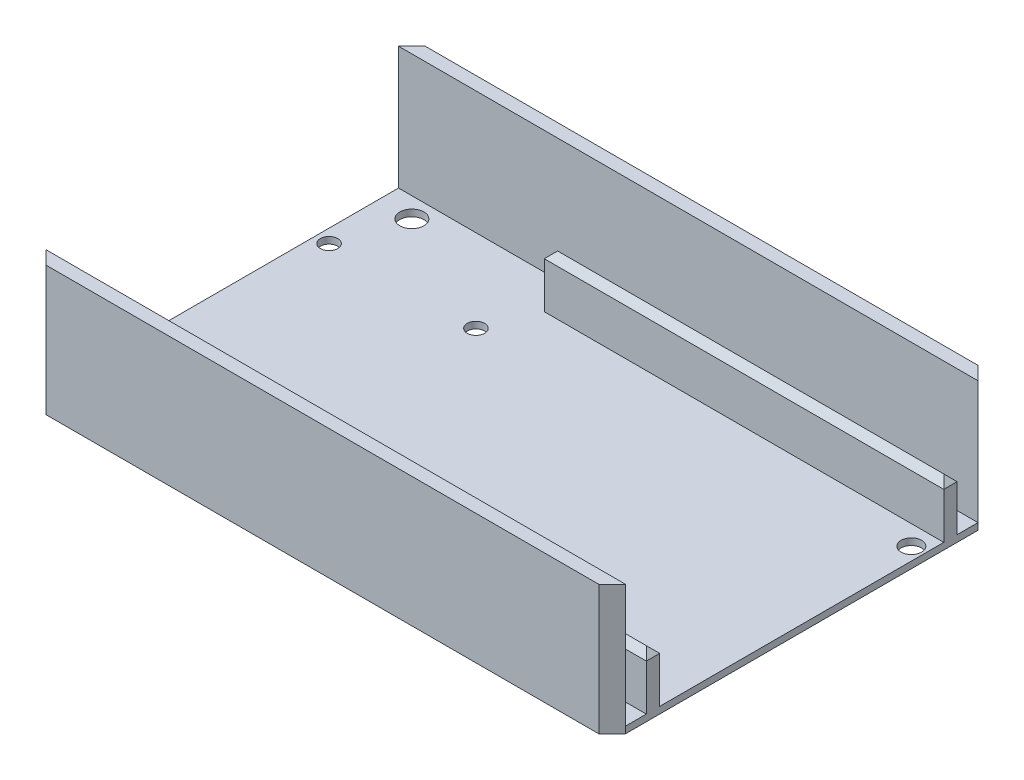
ISO-10303-21;
HEADER;
FILE_DESCRIPTION(('STEP AP214'),'2;1');
FILE_NAME('part.step','',(''),(''),'','','');
FILE_SCHEMA(('AUTOMOTIVE_DESIGN { 1 0 10303 214 1 1 1 1 }'));
ENDSEC;
DATA;
#1=APPLICATION_CONTEXT('core data for automotive mechanical design processes');
#2=APPLICATION_PROTOCOL_DEFINITION('international standard','automotive_design',2000,#1);
#3=PRODUCT_CONTEXT('',#1,'mechanical');
#4=PRODUCT('Part','Part','',(#3));
#5=PRODUCT_RELATED_PRODUCT_CATEGORY('part','',(#4));
#6=PRODUCT_DEFINITION_FORMATION('','',#4);
#7=PRODUCT_DEFINITION_CONTEXT('part definition',#1,'design');
#8=PRODUCT_DEFINITION('design','',#6,#7);
#9=PRODUCT_DEFINITION_SHAPE('','',#8);
#10=(LENGTH_UNIT() NAMED_UNIT(*) SI_UNIT(.MILLI.,.METRE.));
#11=(NAMED_UNIT(*) PLANE_ANGLE_UNIT() SI_UNIT($,.RADIAN.));
#12=(NAMED_UNIT(*) SI_UNIT($,.STERADIAN.) SOLID_ANGLE_UNIT());
#13=UNCERTAINTY_MEASURE_WITH_UNIT(LENGTH_MEASURE(1.E-05),#10,'distance_accuracy_value','');
#14=(GEOMETRIC_REPRESENTATION_CONTEXT(3) GLOBAL_UNCERTAINTY_ASSIGNED_CONTEXT((#13)) GLOBAL_UNIT_ASSIGNED_CONTEXT((#10,
#11,#12)) REPRESENTATION_CONTEXT('',''));
#15=CARTESIAN_POINT('',(0.,0.,0.));
#16=DIRECTION('',(0.,0.,1.));
#17=DIRECTION('',(1.,0.,0.));
#18=AXIS2_PLACEMENT_3D('',#15,#16,#17);
#19=CARTESIAN_POINT('',(0.,1.27,0.));
#20=DIRECTION('',(0.,-1.,0.));
#21=DIRECTION('',(0.,0.,-1.));
#22=AXIS2_PLACEMENT_3D('',#19,#20,#21);
#23=PLANE('',#22);
#24=CARTESIAN_POINT('',(6.35,1.27,-65.786));
#25=DIRECTION('',(0.,1.,0.));
#26=DIRECTION('',(0.,0.,1.));
#27=AXIS2_PLACEMENT_3D('',#24,#25,#26);
#28=CIRCLE('',#27,2.286);
#29=CARTESIAN_POINT('',(6.35,1.27,-63.5));
#30=VERTEX_POINT('',#29);
#31=EDGE_CURVE('E236',#30,#30,#28,.T.);
#32=ORIENTED_EDGE('',*,*,#31,.F.);
#33=EDGE_LOOP('',(#32));
#34=FACE_BOUND('',#33,.T.);
#35=CARTESIAN_POINT('',(6.35,1.27,-6.34999999999999));
#36=DIRECTION('',(0.,1.,0.));
#37=DIRECTION('',(0.,0.,-1.));
#38=AXIS2_PLACEMENT_3D('',#35,#36,#37);
#39=CIRCLE('',#38,2.286);
#40=CARTESIAN_POINT('',(6.35,1.27,-8.63599999999999));
#41=VERTEX_POINT('',#40);
#42=EDGE_CURVE('E231',#41,#41,#39,.T.);
#43=ORIENTED_EDGE('',*,*,#42,.F.);
#44=EDGE_LOOP('',(#43));
#45=FACE_BOUND('',#44,.T.);
#46=CARTESIAN_POINT('',(107.786,1.27,-59.368));
#47=DIRECTION('',(0.,1.,0.));
#48=DIRECTION('',(0.,0.,1.));
#49=AXIS2_PLACEMENT_3D('',#46,#47,#48);
#50=CIRCLE('',#49,1.95);
#51=CARTESIAN_POINT('',(107.786,1.27,-57.418));
#52=VERTEX_POINT('',#51);
#53=EDGE_CURVE('E275',#52,#52,#50,.T.);
#54=ORIENTED_EDGE('',*,*,#53,.F.);
#55=EDGE_LOOP('',(#54));
#56=FACE_BOUND('',#55,.T.);
#57=CARTESIAN_POINT('',(2.54,1.27,-18.288));
#58=DIRECTION('',(0.,1.,0.));
#59=DIRECTION('',(0.,0.,1.));
#60=AXIS2_PLACEMENT_3D('',#57,#58,#59);
#61=CIRCLE('',#60,1.651);
#62=CARTESIAN_POINT('',(2.54,1.27,-16.637));
#63=VERTEX_POINT('',#62);
#64=EDGE_CURVE('E270',#63,#63,#61,.T.);
#65=ORIENTED_EDGE('',*,*,#64,.F.);
#66=EDGE_LOOP('',(#65));
#67=FACE_BOUND('',#66,.T.);
#68=CARTESIAN_POINT('',(38.036,1.27,-17.318));
#69=DIRECTION('',(0.,1.,0.));
#70=DIRECTION('',(0.,0.,1.));
#71=AXIS2_PLACEMENT_3D('',#68,#69,#70);
#72=CIRCLE('',#71,1.95);
#73=CARTESIAN_POINT('',(38.036,1.27,-15.368));
#74=VERTEX_POINT('',#73);
#75=EDGE_CURVE('E299',#74,#74,#72,.T.);
#76=ORIENTED_EDGE('',*,*,#75,.F.);
#77=EDGE_LOOP('',(#76));
#78=FACE_BOUND('',#77,.T.);
#79=CARTESIAN_POINT('',(2.54,1.27,-53.848));
#80=DIRECTION('',(0.,1.,0.));
#81=DIRECTION('',(0.,0.,1.));
#82=AXIS2_PLACEMENT_3D('',#79,#80,#81);
#83=CIRCLE('',#82,1.651);
#84=CARTESIAN_POINT('',(2.54,1.27,-52.197));
#85=VERTEX_POINT('',#84);
#86=EDGE_CURVE('E288',#85,#85,#83,.T.);
#87=ORIENTED_EDGE('',*,*,#86,.F.);
#88=EDGE_LOOP('',(#87));
#89=FACE_BOUND('',#88,.T.);
#90=CARTESIAN_POINT('',(30.48,1.27,-53.848));
#91=DIRECTION('',(0.,1.,0.));
#92=DIRECTION('',(0.,0.,1.));
#93=AXIS2_PLACEMENT_3D('',#90,#91,#92);
#94=CIRCLE('',#93,1.651);
#95=CARTESIAN_POINT('',(30.48,1.27,-52.197));
#96=VERTEX_POINT('',#95);
#97=EDGE_CURVE('E289',#96,#96,#94,.T.);
#98=ORIENTED_EDGE('',*,*,#97,.F.);
#99=EDGE_LOOP('',(#98));
#100=FACE_BOUND('',#99,.T.);
#101=CARTESIAN_POINT('',(30.48,1.27,-18.288));
#102=DIRECTION('',(0.,1.,0.));
#103=DIRECTION('',(0.,0.,1.));
#104=AXIS2_PLACEMENT_3D('',#101,#102,#103);
#105=CIRCLE('',#104,1.651);
#106=CARTESIAN_POINT('',(30.48,1.27,-16.637));
#107=VERTEX_POINT('',#106);
#108=EDGE_CURVE('E282',#107,#107,#105,.T.);
#109=ORIENTED_EDGE('',*,*,#108,.F.);
#110=EDGE_LOOP('',(#109));
#111=FACE_BOUND('',#110,.T.);
#112=DIRECTION('',(1.,0.,0.));
#113=VECTOR('',#112,1.);
#114=CARTESIAN_POINT('',(34.236,1.27,-6.50799999999999));
#115=LINE('',#114,#113);
#116=CARTESIAN_POINT('',(34.236,1.27,-6.50799999999999));
#117=VERTEX_POINT('',#116);
#118=CARTESIAN_POINT('',(110.236,1.27,-6.50799999999999));
#119=VERTEX_POINT('',#118);
#120=EDGE_CURVE('E206',#117,#119,#115,.T.);
#121=ORIENTED_EDGE('',*,*,#120,.F.);
#122=DIRECTION('',(0.,0.,1.));
#123=VECTOR('',#122,1.);
#124=CARTESIAN_POINT('',(34.236,1.27,-9.04799999999999));
#125=LINE('',#124,#123);
#126=CARTESIAN_POINT('',(34.236,1.27,-9.04799999999999));
#127=VERTEX_POINT('',#126);
#128=EDGE_CURVE('E205',#127,#117,#125,.T.);
#129=ORIENTED_EDGE('',*,*,#128,.F.);
#130=DIRECTION('',(-1.,0.,0.));
#131=VECTOR('',#130,1.);
#132=CARTESIAN_POINT('',(34.236,1.27,-9.04799999999999));
#133=LINE('',#132,#131);
#134=CARTESIAN_POINT('',(110.236,1.27,-9.04799999999999));
#135=VERTEX_POINT('',#134);
#136=EDGE_CURVE('E183',#135,#127,#133,.T.);
#137=ORIENTED_EDGE('',*,*,#136,.F.);
#138=DIRECTION('',(0.,0.,-1.));
#139=VECTOR('',#138,1.);
#140=CARTESIAN_POINT('',(110.236,1.27,0.));
#141=LINE('',#140,#139);
#142=CARTESIAN_POINT('',(110.236,1.27,-63.088));
#143=VERTEX_POINT('',#142);
#144=EDGE_CURVE('E191',#135,#143,#141,.T.);
#145=ORIENTED_EDGE('',*,*,#144,.T.);
#146=DIRECTION('',(1.,0.,0.));
#147=VECTOR('',#146,1.);
#148=CARTESIAN_POINT('',(34.236,1.27,-63.088));
#149=LINE('',#148,#147);
#150=CARTESIAN_POINT('',(34.236,1.27,-63.088));
#151=VERTEX_POINT('',#150);
#152=EDGE_CURVE('E219',#151,#143,#149,.T.);
#153=ORIENTED_EDGE('',*,*,#152,.F.);
#154=DIRECTION('',(0.,0.,1.));
#155=VECTOR('',#154,1.);
#156=CARTESIAN_POINT('',(34.236,1.27,-65.628));
#157=LINE('',#156,#155);
#158=CARTESIAN_POINT('',(34.236,1.27,-65.628));
#159=VERTEX_POINT('',#158);
#160=EDGE_CURVE('E216',#159,#151,#157,.T.);
#161=ORIENTED_EDGE('',*,*,#160,.F.);
#162=DIRECTION('',(-1.,0.,0.));
#163=VECTOR('',#162,1.);
#164=CARTESIAN_POINT('',(34.236,1.27,-65.628));
#165=LINE('',#164,#163);
#166=CARTESIAN_POINT('',(110.236,1.27,-65.628));
#167=VERTEX_POINT('',#166);
#168=EDGE_CURVE('E221',#167,#159,#165,.T.);
#169=ORIENTED_EDGE('',*,*,#168,.F.);
#170=CARTESIAN_POINT('',(110.236,1.27,-69.596));
#171=VERTEX_POINT('',#170);
#172=EDGE_CURVE('E200',#167,#171,#141,.T.);
#173=ORIENTED_EDGE('',*,*,#172,.T.);
#174=DIRECTION('',(1.,0.,0.));
#175=VECTOR('',#174,1.);
#176=CARTESIAN_POINT('',(0.,1.27,-69.596));
#177=LINE('',#176,#175);
#178=CARTESIAN_POINT('',(0.,1.27,-69.596));
#179=VERTEX_POINT('',#178);
#180=EDGE_CURVE('E257',#179,#171,#177,.T.);
#181=ORIENTED_EDGE('',*,*,#180,.F.);
#182=DIRECTION('',(0.,0.,1.));
#183=VECTOR('',#182,1.);
#184=CARTESIAN_POINT('',(0.,1.27,0.));
#185=LINE('',#184,#183);
#186=CARTESIAN_POINT('',(0.,1.27,-2.54));
#187=VERTEX_POINT('',#186);
#188=EDGE_CURVE('E307',#179,#187,#185,.T.);
#189=ORIENTED_EDGE('',*,*,#188,.T.);
#190=DIRECTION('',(-1.,0.,0.));
#191=VECTOR('',#190,1.);
#192=CARTESIAN_POINT('',(110.236,1.27,-2.54));
#193=LINE('',#192,#191);
#194=CARTESIAN_POINT('',(110.236,1.27,-2.54));
#195=VERTEX_POINT('',#194);
#196=EDGE_CURVE('E235',#195,#187,#193,.T.);
#197=ORIENTED_EDGE('',*,*,#196,.F.);
#198=EDGE_CURVE('E199',#195,#119,#141,.T.);
#199=ORIENTED_EDGE('',*,*,#198,.T.);
#200=EDGE_LOOP('',(#121,#129,#137,#145,#153,#161,#169,#173,#181,#189,#197,#199));
#201=FACE_BOUND('',#200,.T.);
#202=ADVANCED_FACE('F39',(#34,#45,#56,#67,#78,#89,#100,#111,#201),#23,.F.);
#203=CARTESIAN_POINT('',(0.,1.27,0.));
#204=DIRECTION('',(1.,0.,0.));
#205=DIRECTION('',(0.,0.,-1.));
#206=AXIS2_PLACEMENT_3D('',#203,#204,#205);
#207=PLANE('',#206);
#208=ORIENTED_EDGE('',*,*,#188,.F.);
#209=DIRECTION('',(0.,-1.,0.));
#210=VECTOR('',#209,1.);
#211=CARTESIAN_POINT('',(0.,1.27,-69.596));
#212=LINE('',#211,#210);
#213=CARTESIAN_POINT('',(0.,0.,-69.596));
#214=VERTEX_POINT('',#213);
#215=EDGE_CURVE('E11',#179,#214,#212,.T.);
#216=ORIENTED_EDGE('',*,*,#215,.T.);
#217=DIRECTION('',(0.,0.,1.));
#218=VECTOR('',#217,1.);
#219=CARTESIAN_POINT('',(0.,0.,0.));
#220=LINE('',#219,#218);
#221=CARTESIAN_POINT('',(0.,0.,-2.53999999999999));
#222=VERTEX_POINT('',#221);
#223=EDGE_CURVE('E274',#214,#222,#220,.T.);
#224=ORIENTED_EDGE('',*,*,#223,.T.);
#225=DIRECTION('',(0.,1.,0.));
#226=VECTOR('',#225,1.);
#227=CARTESIAN_POINT('',(0.,1.27,-2.53999999999999));
#228=LINE('',#227,#226);
#229=EDGE_CURVE('E48',#222,#187,#228,.T.);
#230=ORIENTED_EDGE('',*,*,#229,.T.);
#231=EDGE_LOOP('',(#208,#216,#224,#230));
#232=FACE_BOUND('',#231,.T.);
#233=ADVANCED_FACE('F391',(#232),#207,.F.);
#234=CARTESIAN_POINT('',(0.,1.27,0.));
#235=DIRECTION('',(0.,0.,-1.));
#236=DIRECTION('',(-1.,0.,0.));
#237=AXIS2_PLACEMENT_3D('',#234,#235,#236);
#238=PLANE('',#237);
#239=DIRECTION('',(1.,0.,0.));
#240=VECTOR('',#239,1.);
#241=CARTESIAN_POINT('',(0.,0.,0.));
#242=LINE('',#241,#240);
#243=CARTESIAN_POINT('',(2.53999999999997,0.,0.));
#244=VERTEX_POINT('',#243);
#245=CARTESIAN_POINT('',(107.696,0.,0.));
#246=VERTEX_POINT('',#245);
#247=EDGE_CURVE('E315',#244,#246,#242,.T.);
#248=ORIENTED_EDGE('',*,*,#247,.T.);
#249=DIRECTION('',(0.,1.,0.));
#250=VECTOR('',#249,1.);
#251=CARTESIAN_POINT('',(107.696,1.27,0.));
#252=LINE('',#251,#250);
#253=CARTESIAN_POINT('',(107.696,24.64054,0.));
#254=VERTEX_POINT('',#253);
#255=EDGE_CURVE('E376',#246,#254,#252,.T.);
#256=ORIENTED_EDGE('',*,*,#255,.T.);
#257=DIRECTION('',(1.,0.,0.));
#258=VECTOR('',#257,1.);
#259=CARTESIAN_POINT('',(110.236,24.64054,0.));
#260=LINE('',#259,#258);
#261=CARTESIAN_POINT('',(2.54,24.64054,0.));
#262=VERTEX_POINT('',#261);
#263=EDGE_CURVE('E246',#262,#254,#260,.T.);
#264=ORIENTED_EDGE('',*,*,#263,.F.);
#265=DIRECTION('',(0.,-1.,0.));
#266=VECTOR('',#265,1.);
#267=CARTESIAN_POINT('',(2.53999999999997,1.27,0.));
#268=LINE('',#267,#266);
#269=EDGE_CURVE('E373',#262,#244,#268,.T.);
#270=ORIENTED_EDGE('',*,*,#269,.T.);
#271=EDGE_LOOP('',(#248,#256,#264,#270));
#272=FACE_BOUND('',#271,.T.);
#273=ADVANCED_FACE('F409',(#272),#238,.F.);
#274=CARTESIAN_POINT('',(110.236,1.27,0.));
#275=DIRECTION('',(-1.,0.,0.));
#276=DIRECTION('',(0.,0.,1.));
#277=AXIS2_PLACEMENT_3D('',#274,#275,#276);
#278=PLANE('',#277);
#279=ORIENTED_EDGE('',*,*,#198,.F.);
#280=DIRECTION('',(0.,-1.,0.));
#281=VECTOR('',#280,1.);
#282=CARTESIAN_POINT('',(110.236,1.27,-2.53999999999997));
#283=LINE('',#282,#281);
#284=CARTESIAN_POINT('',(110.236,0.,-2.53999999999997));
#285=VERTEX_POINT('',#284);
#286=EDGE_CURVE('E363',#195,#285,#283,.T.);
#287=ORIENTED_EDGE('',*,*,#286,.T.);
#288=DIRECTION('',(0.,0.,-1.));
#289=VECTOR('',#288,1.);
#290=CARTESIAN_POINT('',(110.236,0.,0.));
#291=LINE('',#290,#289);
#292=CARTESIAN_POINT('',(110.236,0.,-69.596));
#293=VERTEX_POINT('',#292);
#294=EDGE_CURVE('E318',#285,#293,#291,.T.);
#295=ORIENTED_EDGE('',*,*,#294,.T.);
#296=DIRECTION('',(0.,1.,0.));
#297=VECTOR('',#296,1.);
#298=CARTESIAN_POINT('',(110.236,1.27,-69.596));
#299=LINE('',#298,#297);
#300=EDGE_CURVE('E337',#293,#171,#299,.T.);
#301=ORIENTED_EDGE('',*,*,#300,.T.);
#302=ORIENTED_EDGE('',*,*,#172,.F.);
#303=DIRECTION('',(0.,-1.,0.));
#304=VECTOR('',#303,1.);
#305=CARTESIAN_POINT('',(110.236,11.27,-65.628));
#306=LINE('',#305,#304);
#307=CARTESIAN_POINT('',(110.236,9.99999999999999,-65.628));
#308=VERTEX_POINT('',#307);
#309=EDGE_CURVE('E226',#308,#167,#306,.T.);
#310=ORIENTED_EDGE('',*,*,#309,.F.);
#311=DIRECTION('',(0.,0.,1.));
#312=VECTOR('',#311,1.);
#313=CARTESIAN_POINT('',(110.236,9.99999999999999,-63.088));
#314=LINE('',#313,#312);
#315=CARTESIAN_POINT('',(110.236,9.99999999999999,-63.088));
#316=VERTEX_POINT('',#315);
#317=EDGE_CURVE('E326',#308,#316,#314,.T.);
#318=ORIENTED_EDGE('',*,*,#317,.T.);
#319=DIRECTION('',(0.,-1.,0.));
#320=VECTOR('',#319,1.);
#321=CARTESIAN_POINT('',(110.236,11.27,-63.088));
#322=LINE('',#321,#320);
#323=EDGE_CURVE('E195',#316,#143,#322,.T.);
#324=ORIENTED_EDGE('',*,*,#323,.T.);
#325=ORIENTED_EDGE('',*,*,#144,.F.);
#326=DIRECTION('',(0.,-1.,0.));
#327=VECTOR('',#326,1.);
#328=CARTESIAN_POINT('',(110.236,11.27,-9.04799999999999));
#329=LINE('',#328,#327);
#330=CARTESIAN_POINT('',(110.236,9.99999999999999,-9.04799999999999));
#331=VERTEX_POINT('',#330);
#332=EDGE_CURVE('E178',#331,#135,#329,.T.);
#333=ORIENTED_EDGE('',*,*,#332,.F.);
#334=DIRECTION('',(0.,0.,1.));
#335=VECTOR('',#334,1.);
#336=CARTESIAN_POINT('',(110.236,9.99999999999999,-6.50799999999999));
#337=LINE('',#336,#335);
#338=CARTESIAN_POINT('',(110.236,9.99999999999999,-6.50799999999999));
#339=VERTEX_POINT('',#338);
#340=EDGE_CURVE('E324',#331,#339,#337,.T.);
#341=ORIENTED_EDGE('',*,*,#340,.T.);
#342=DIRECTION('',(0.,-1.,0.));
#343=VECTOR('',#342,1.);
#344=CARTESIAN_POINT('',(110.236,11.27,-6.50799999999999));
#345=LINE('',#344,#343);
#346=EDGE_CURVE('E187',#339,#119,#345,.T.);
#347=ORIENTED_EDGE('',*,*,#346,.T.);
#348=EDGE_LOOP('',(#279,#287,#295,#301,#302,#310,#318,#324,#325,#333,#341,#347));
#349=FACE_BOUND('',#348,.T.);
#350=ADVANCED_FACE('F193',(#349),#278,.F.);
#351=CARTESIAN_POINT('',(0.,1.27,-72.136));
#352=DIRECTION('',(0.,0.,1.));
#353=DIRECTION('',(1.,0.,0.));
#354=AXIS2_PLACEMENT_3D('',#351,#352,#353);
#355=PLANE('',#354);
#356=DIRECTION('',(-1.,0.,0.));
#357=VECTOR('',#356,1.);
#358=CARTESIAN_POINT('',(0.,24.64054,-72.136));
#359=LINE('',#358,#357);
#360=CARTESIAN_POINT('',(107.696,24.64054,-72.136));
#361=VERTEX_POINT('',#360);
#362=CARTESIAN_POINT('',(2.54000000000001,24.64054,-72.136));
#363=VERTEX_POINT('',#362);
#364=EDGE_CURVE('E260',#361,#363,#359,.T.);
#365=ORIENTED_EDGE('',*,*,#364,.F.);
#366=DIRECTION('',(0.,-1.,0.));
#367=VECTOR('',#366,1.);
#368=CARTESIAN_POINT('',(107.696,1.27,-72.136));
#369=LINE('',#368,#367);
#370=CARTESIAN_POINT('',(107.696,0.,-72.136));
#371=VERTEX_POINT('',#370);
#372=EDGE_CURVE('E383',#361,#371,#369,.T.);
#373=ORIENTED_EDGE('',*,*,#372,.T.);
#374=DIRECTION('',(-1.,0.,0.));
#375=VECTOR('',#374,1.);
#376=CARTESIAN_POINT('',(0.,0.,-72.136));
#377=LINE('',#376,#375);
#378=CARTESIAN_POINT('',(2.54000000000001,0.,-72.136));
#379=VERTEX_POINT('',#378);
#380=EDGE_CURVE('E309',#371,#379,#377,.T.);
#381=ORIENTED_EDGE('',*,*,#380,.T.);
#382=DIRECTION('',(0.,1.,0.));
#383=VECTOR('',#382,1.);
#384=CARTESIAN_POINT('',(2.54000000000001,1.27,-72.136));
#385=LINE('',#384,#383);
#386=EDGE_CURVE('E55',#379,#363,#385,.T.);
#387=ORIENTED_EDGE('',*,*,#386,.T.);
#388=EDGE_LOOP('',(#365,#373,#381,#387));
#389=FACE_BOUND('',#388,.T.);
#390=ADVANCED_FACE('F468',(#389),#355,.F.);
#391=CARTESIAN_POINT('',(0.,0.,0.));
#392=DIRECTION('',(0.,-1.,0.));
#393=DIRECTION('',(0.,0.,-1.));
#394=AXIS2_PLACEMENT_3D('',#391,#392,#393);
#395=PLANE('',#394);
#396=CARTESIAN_POINT('',(6.35,0.,-65.786));
#397=DIRECTION('',(0.,1.,0.));
#398=DIRECTION('',(0.,0.,1.));
#399=AXIS2_PLACEMENT_3D('',#396,#397,#398);
#400=CIRCLE('',#399,2.286);
#401=CARTESIAN_POINT('',(6.35,0.,-63.5));
#402=VERTEX_POINT('',#401);
#403=EDGE_CURVE('E232',#402,#402,#400,.T.);
#404=ORIENTED_EDGE('',*,*,#403,.T.);
#405=EDGE_LOOP('',(#404));
#406=FACE_BOUND('',#405,.T.);
#407=CARTESIAN_POINT('',(6.35,0.,-6.34999999999999));
#408=DIRECTION('',(0.,1.,0.));
#409=DIRECTION('',(0.,0.,-1.));
#410=AXIS2_PLACEMENT_3D('',#407,#408,#409);
#411=CIRCLE('',#410,2.286);
#412=CARTESIAN_POINT('',(6.35,0.,-8.63599999999999));
#413=VERTEX_POINT('',#412);
#414=EDGE_CURVE('E239',#413,#413,#411,.T.);
#415=ORIENTED_EDGE('',*,*,#414,.T.);
#416=EDGE_LOOP('',(#415));
#417=FACE_BOUND('',#416,.T.);
#418=CARTESIAN_POINT('',(107.786,0.,-59.368));
#419=DIRECTION('',(0.,1.,0.));
#420=DIRECTION('',(0.,0.,1.));
#421=AXIS2_PLACEMENT_3D('',#418,#419,#420);
#422=CIRCLE('',#421,1.95);
#423=CARTESIAN_POINT('',(107.786,0.,-57.418));
#424=VERTEX_POINT('',#423);
#425=EDGE_CURVE('E271',#424,#424,#422,.T.);
#426=ORIENTED_EDGE('',*,*,#425,.T.);
#427=EDGE_LOOP('',(#426));
#428=FACE_BOUND('',#427,.T.);
#429=CARTESIAN_POINT('',(2.54,0.,-18.288));
#430=DIRECTION('',(0.,1.,0.));
#431=DIRECTION('',(0.,0.,1.));
#432=AXIS2_PLACEMENT_3D('',#429,#430,#431);
#433=CIRCLE('',#432,1.651);
#434=CARTESIAN_POINT('',(2.54,0.,-16.637));
#435=VERTEX_POINT('',#434);
#436=EDGE_CURVE('E279',#435,#435,#433,.T.);
#437=ORIENTED_EDGE('',*,*,#436,.T.);
#438=EDGE_LOOP('',(#437));
#439=FACE_BOUND('',#438,.T.);
#440=CARTESIAN_POINT('',(38.036,0.,-17.318));
#441=DIRECTION('',(0.,1.,0.));
#442=DIRECTION('',(0.,0.,1.));
#443=AXIS2_PLACEMENT_3D('',#440,#441,#442);
#444=CIRCLE('',#443,1.95);
#445=CARTESIAN_POINT('',(38.036,0.,-15.368));
#446=VERTEX_POINT('',#445);
#447=EDGE_CURVE('E278',#446,#446,#444,.T.);
#448=ORIENTED_EDGE('',*,*,#447,.T.);
#449=EDGE_LOOP('',(#448));
#450=FACE_BOUND('',#449,.T.);
#451=CARTESIAN_POINT('',(2.54,0.,-53.848));
#452=DIRECTION('',(0.,1.,0.));
#453=DIRECTION('',(0.,0.,1.));
#454=AXIS2_PLACEMENT_3D('',#451,#452,#453);
#455=CIRCLE('',#454,1.651);
#456=CARTESIAN_POINT('',(2.54,0.,-52.197));
#457=VERTEX_POINT('',#456);
#458=EDGE_CURVE('E302',#457,#457,#455,.T.);
#459=ORIENTED_EDGE('',*,*,#458,.T.);
#460=EDGE_LOOP('',(#459));
#461=FACE_BOUND('',#460,.T.);
#462=CARTESIAN_POINT('',(30.48,0.,-53.848));
#463=DIRECTION('',(0.,1.,0.));
#464=DIRECTION('',(0.,0.,1.));
#465=AXIS2_PLACEMENT_3D('',#462,#463,#464);
#466=CIRCLE('',#465,1.651);
#467=CARTESIAN_POINT('',(30.48,0.,-52.197));
#468=VERTEX_POINT('',#467);
#469=EDGE_CURVE('E285',#468,#468,#466,.T.);
#470=ORIENTED_EDGE('',*,*,#469,.T.);
#471=EDGE_LOOP('',(#470));
#472=FACE_BOUND('',#471,.T.);
#473=CARTESIAN_POINT('',(30.48,0.,-18.288));
#474=DIRECTION('',(0.,1.,0.));
#475=DIRECTION('',(0.,0.,1.));
#476=AXIS2_PLACEMENT_3D('',#473,#474,#475);
#477=CIRCLE('',#476,1.651);
#478=CARTESIAN_POINT('',(30.48,0.,-16.637));
#479=VERTEX_POINT('',#478);
#480=EDGE_CURVE('E292',#479,#479,#477,.T.);
#481=ORIENTED_EDGE('',*,*,#480,.T.);
#482=EDGE_LOOP('',(#481));
#483=FACE_BOUND('',#482,.T.);
#484=ORIENTED_EDGE('',*,*,#294,.F.);
#485=DIRECTION('',(0.707106781186549,0.,-0.707106781186546));
#486=VECTOR('',#485,1.);
#487=CARTESIAN_POINT('',(53.8479999999997,0.,53.848));
#488=LINE('',#487,#486);
#489=EDGE_CURVE('E371',#285,#246,#488,.F.);
#490=ORIENTED_EDGE('',*,*,#489,.T.);
#491=ORIENTED_EDGE('',*,*,#247,.F.);
#492=DIRECTION('',(0.707106781186546,0.,0.707106781186549));
#493=VECTOR('',#492,1.);
#494=CARTESIAN_POINT('',(1.26999999999999,0.,-1.26999999999999));
#495=LINE('',#494,#493);
#496=EDGE_CURVE('E365',#244,#222,#495,.F.);
#497=ORIENTED_EDGE('',*,*,#496,.T.);
#498=ORIENTED_EDGE('',*,*,#223,.F.);
#499=DIRECTION('',(-0.70710678118655,0.,0.707106781186546));
#500=VECTOR('',#499,1.);
#501=CARTESIAN_POINT('',(-34.798,0.,-34.7980000000002));
#502=LINE('',#501,#500);
#503=EDGE_CURVE('E367',#214,#379,#502,.F.);
#504=ORIENTED_EDGE('',*,*,#503,.T.);
#505=ORIENTED_EDGE('',*,*,#380,.F.);
#506=DIRECTION('',(-0.707106781186544,0.,-0.707106781186551));
#507=VECTOR('',#506,1.);
#508=CARTESIAN_POINT('',(89.9160000000006,0.,-89.9159999999996));
#509=LINE('',#508,#507);
#510=EDGE_CURVE('E369',#371,#293,#509,.F.);
#511=ORIENTED_EDGE('',*,*,#510,.T.);
#512=EDGE_LOOP('',(#484,#490,#491,#497,#498,#504,#505,#511));
#513=FACE_BOUND('',#512,.T.);
#514=ADVANCED_FACE('F464',(#406,#417,#428,#439,#450,#461,#472,#483,#513),#395,.T.);
#515=CARTESIAN_POINT('',(30.48,0.,-18.288));
#516=DIRECTION('',(0.,1.,0.));
#517=DIRECTION('',(0.,0.,1.));
#518=AXIS2_PLACEMENT_3D('',#515,#516,#517);
#519=CYLINDRICAL_SURFACE('',#518,1.651);
#520=ORIENTED_EDGE('',*,*,#480,.F.);
#521=EDGE_LOOP('',(#520));
#522=FACE_BOUND('',#521,.T.);
#523=ORIENTED_EDGE('',*,*,#108,.T.);
#524=EDGE_LOOP('',(#523));
#525=FACE_BOUND('',#524,.T.);
#526=ADVANCED_FACE('F467',(#522,#525),#519,.F.);
#527=CARTESIAN_POINT('',(30.48,0.,-53.848));
#528=DIRECTION('',(0.,1.,0.));
#529=DIRECTION('',(0.,0.,1.));
#530=AXIS2_PLACEMENT_3D('',#527,#528,#529);
#531=CYLINDRICAL_SURFACE('',#530,1.651);
#532=ORIENTED_EDGE('',*,*,#469,.F.);
#533=EDGE_LOOP('',(#532));
#534=FACE_BOUND('',#533,.T.);
#535=ORIENTED_EDGE('',*,*,#97,.T.);
#536=EDGE_LOOP('',(#535));
#537=FACE_BOUND('',#536,.T.);
#538=ADVANCED_FACE('F794',(#534,#537),#531,.F.);
#539=CARTESIAN_POINT('',(2.54,0.,-53.848));
#540=DIRECTION('',(0.,1.,0.));
#541=DIRECTION('',(0.,0.,1.));
#542=AXIS2_PLACEMENT_3D('',#539,#540,#541);
#543=CYLINDRICAL_SURFACE('',#542,1.651);
#544=ORIENTED_EDGE('',*,*,#458,.F.);
#545=EDGE_LOOP('',(#544));
#546=FACE_BOUND('',#545,.T.);
#547=ORIENTED_EDGE('',*,*,#86,.T.);
#548=EDGE_LOOP('',(#547));
#549=FACE_BOUND('',#548,.T.);
#550=ADVANCED_FACE('F462',(#546,#549),#543,.F.);
#551=CARTESIAN_POINT('',(38.036,0.,-17.318));
#552=DIRECTION('',(0.,1.,0.));
#553=DIRECTION('',(0.,0.,1.));
#554=AXIS2_PLACEMENT_3D('',#551,#552,#553);
#555=CYLINDRICAL_SURFACE('',#554,1.95);
#556=ORIENTED_EDGE('',*,*,#447,.F.);
#557=EDGE_LOOP('',(#556));
#558=FACE_BOUND('',#557,.T.);
#559=ORIENTED_EDGE('',*,*,#75,.T.);
#560=EDGE_LOOP('',(#559));
#561=FACE_BOUND('',#560,.T.);
#562=ADVANCED_FACE('F778',(#558,#561),#555,.F.);
#563=CARTESIAN_POINT('',(2.54,0.,-18.288));
#564=DIRECTION('',(0.,1.,0.));
#565=DIRECTION('',(0.,0.,1.));
#566=AXIS2_PLACEMENT_3D('',#563,#564,#565);
#567=CYLINDRICAL_SURFACE('',#566,1.651);
#568=ORIENTED_EDGE('',*,*,#436,.F.);
#569=EDGE_LOOP('',(#568));
#570=FACE_BOUND('',#569,.T.);
#571=ORIENTED_EDGE('',*,*,#64,.T.);
#572=EDGE_LOOP('',(#571));
#573=FACE_BOUND('',#572,.T.);
#574=ADVANCED_FACE('F769',(#570,#573),#567,.F.);
#575=CARTESIAN_POINT('',(107.786,0.,-59.368));
#576=DIRECTION('',(0.,1.,0.));
#577=DIRECTION('',(0.,0.,1.));
#578=AXIS2_PLACEMENT_3D('',#575,#576,#577);
#579=CYLINDRICAL_SURFACE('',#578,1.95);
#580=ORIENTED_EDGE('',*,*,#425,.F.);
#581=EDGE_LOOP('',(#580));
#582=FACE_BOUND('',#581,.T.);
#583=ORIENTED_EDGE('',*,*,#53,.T.);
#584=EDGE_LOOP('',(#583));
#585=FACE_BOUND('',#584,.T.);
#586=ADVANCED_FACE('F677',(#582,#585),#579,.F.);
#587=CARTESIAN_POINT('',(0.,24.64054,-69.596));
#588=DIRECTION('',(0.,0.,-1.));
#589=DIRECTION('',(-1.,0.,0.));
#590=AXIS2_PLACEMENT_3D('',#587,#588,#589);
#591=PLANE('',#590);
#592=ORIENTED_EDGE('',*,*,#180,.T.);
#593=DIRECTION('',(0.,-1.,0.));
#594=VECTOR('',#593,1.);
#595=CARTESIAN_POINT('',(110.236,24.64054,-69.596));
#596=LINE('',#595,#594);
#597=CARTESIAN_POINT('',(110.236,24.64054,-69.596));
#598=VERTEX_POINT('',#597);
#599=EDGE_CURVE('E262',#598,#171,#596,.T.);
#600=ORIENTED_EDGE('',*,*,#599,.F.);
#601=DIRECTION('',(1.,0.,0.));
#602=VECTOR('',#601,1.);
#603=CARTESIAN_POINT('',(0.,24.64054,-69.596));
#604=LINE('',#603,#602);
#605=CARTESIAN_POINT('',(0.,24.64054,-69.596));
#606=VERTEX_POINT('',#605);
#607=EDGE_CURVE('E258',#606,#598,#604,.T.);
#608=ORIENTED_EDGE('',*,*,#607,.F.);
#609=DIRECTION('',(0.,-1.,0.));
#610=VECTOR('',#609,1.);
#611=CARTESIAN_POINT('',(0.,24.64054,-69.596));
#612=LINE('',#611,#610);
#613=EDGE_CURVE('E267',#606,#179,#612,.T.);
#614=ORIENTED_EDGE('',*,*,#613,.T.);
#615=EDGE_LOOP('',(#592,#600,#608,#614));
#616=FACE_BOUND('',#615,.T.);
#617=ADVANCED_FACE('F672',(#616),#591,.F.);
#618=CARTESIAN_POINT('',(0.,24.64054,0.));
#619=DIRECTION('',(0.,1.,0.));
#620=DIRECTION('',(0.,0.,1.));
#621=AXIS2_PLACEMENT_3D('',#618,#619,#620);
#622=PLANE('',#621);
#623=ORIENTED_EDGE('',*,*,#607,.T.);
#624=DIRECTION('',(0.707106781186544,0.,0.707106781186551));
#625=VECTOR('',#624,1.);
#626=CARTESIAN_POINT('',(89.9160000000006,24.64054,-89.9159999999996));
#627=LINE('',#626,#625);
#628=EDGE_CURVE('E62',#598,#361,#627,.F.);
#629=ORIENTED_EDGE('',*,*,#628,.T.);
#630=ORIENTED_EDGE('',*,*,#364,.T.);
#631=DIRECTION('',(0.70710678118655,0.,-0.707106781186546));
#632=VECTOR('',#631,1.);
#633=CARTESIAN_POINT('',(-34.798,24.64054,-34.7980000000002));
#634=LINE('',#633,#632);
#635=EDGE_CURVE('E386',#363,#606,#634,.F.);
#636=ORIENTED_EDGE('',*,*,#635,.T.);
#637=EDGE_LOOP('',(#623,#629,#630,#636));
#638=FACE_BOUND('',#637,.T.);
#639=ADVANCED_FACE('F676',(#638),#622,.T.);
#640=CARTESIAN_POINT('',(110.236,24.64054,-2.54));
#641=DIRECTION('',(0.,0.,1.));
#642=DIRECTION('',(1.,0.,0.));
#643=AXIS2_PLACEMENT_3D('',#640,#641,#642);
#644=PLANE('',#643);
#645=ORIENTED_EDGE('',*,*,#196,.T.);
#646=DIRECTION('',(0.,-1.,0.));
#647=VECTOR('',#646,1.);
#648=CARTESIAN_POINT('',(0.,24.64054,-2.53999999999999));
#649=LINE('',#648,#647);
#650=CARTESIAN_POINT('',(0.,24.64054,-2.53999999999999));
#651=VERTEX_POINT('',#650);
#652=EDGE_CURVE('E249',#651,#187,#649,.T.);
#653=ORIENTED_EDGE('',*,*,#652,.F.);
#654=DIRECTION('',(-1.,0.,0.));
#655=VECTOR('',#654,1.);
#656=CARTESIAN_POINT('',(110.236,24.64054,-2.54));
#657=LINE('',#656,#655);
#658=CARTESIAN_POINT('',(110.236,24.64054,-2.54));
#659=VERTEX_POINT('',#658);
#660=EDGE_CURVE('E244',#659,#651,#657,.T.);
#661=ORIENTED_EDGE('',*,*,#660,.F.);
#662=DIRECTION('',(0.,-1.,0.));
#663=VECTOR('',#662,1.);
#664=CARTESIAN_POINT('',(110.236,24.64054,-2.54));
#665=LINE('',#664,#663);
#666=EDGE_CURVE('E254',#659,#195,#665,.T.);
#667=ORIENTED_EDGE('',*,*,#666,.T.);
#668=EDGE_LOOP('',(#645,#653,#661,#667));
#669=FACE_BOUND('',#668,.T.);
#670=ADVANCED_FACE('F399',(#669),#644,.F.);
#671=CARTESIAN_POINT('',(0.,24.64054,0.));
#672=DIRECTION('',(0.,1.,0.));
#673=DIRECTION('',(0.,0.,1.));
#674=AXIS2_PLACEMENT_3D('',#671,#672,#673);
#675=PLANE('',#674);
#676=ORIENTED_EDGE('',*,*,#263,.T.);
#677=DIRECTION('',(-0.707106781186549,0.,0.707106781186546));
#678=VECTOR('',#677,1.);
#679=CARTESIAN_POINT('',(53.8479999999997,24.64054,53.848));
#680=LINE('',#679,#678);
#681=EDGE_CURVE('E380',#254,#659,#680,.F.);
#682=ORIENTED_EDGE('',*,*,#681,.T.);
#683=ORIENTED_EDGE('',*,*,#660,.T.);
#684=DIRECTION('',(-0.707106781186546,0.,-0.707106781186549));
#685=VECTOR('',#684,1.);
#686=CARTESIAN_POINT('',(1.26999999999999,24.64054,-1.26999999999999));
#687=LINE('',#686,#685);
#688=EDGE_CURVE('E378',#651,#262,#687,.F.);
#689=ORIENTED_EDGE('',*,*,#688,.T.);
#690=EDGE_LOOP('',(#676,#682,#683,#689));
#691=FACE_BOUND('',#690,.T.);
#692=ADVANCED_FACE('F406',(#691),#675,.T.);
#693=CARTESIAN_POINT('',(6.35,0.,-6.34999999999999));
#694=DIRECTION('',(0.,1.,0.));
#695=DIRECTION('',(0.,0.,1.));
#696=AXIS2_PLACEMENT_3D('',#693,#694,#695);
#697=CYLINDRICAL_SURFACE('',#696,2.286);
#698=ORIENTED_EDGE('',*,*,#414,.F.);
#699=EDGE_LOOP('',(#698));
#700=FACE_BOUND('',#699,.T.);
#701=ORIENTED_EDGE('',*,*,#42,.T.);
#702=EDGE_LOOP('',(#701));
#703=FACE_BOUND('',#702,.T.);
#704=ADVANCED_FACE('F702',(#700,#703),#697,.F.);
#705=CARTESIAN_POINT('',(6.35,0.,-65.786));
#706=DIRECTION('',(0.,1.,0.));
#707=DIRECTION('',(0.,0.,1.));
#708=AXIS2_PLACEMENT_3D('',#705,#706,#707);
#709=CYLINDRICAL_SURFACE('',#708,2.286);
#710=ORIENTED_EDGE('',*,*,#403,.F.);
#711=EDGE_LOOP('',(#710));
#712=FACE_BOUND('',#711,.T.);
#713=ORIENTED_EDGE('',*,*,#31,.T.);
#714=EDGE_LOOP('',(#713));
#715=FACE_BOUND('',#714,.T.);
#716=ADVANCED_FACE('F636',(#712,#715),#709,.F.);
#717=CARTESIAN_POINT('',(34.236,11.27,-65.628));
#718=DIRECTION('',(1.,0.,0.));
#719=DIRECTION('',(0.,0.,-1.));
#720=AXIS2_PLACEMENT_3D('',#717,#718,#719);
#721=PLANE('',#720);
#722=DIRECTION('',(0.,-1.,0.));
#723=VECTOR('',#722,1.);
#724=CARTESIAN_POINT('',(34.236,11.27,-63.088));
#725=LINE('',#724,#723);
#726=CARTESIAN_POINT('',(34.236,9.99999999999999,-63.088));
#727=VERTEX_POINT('',#726);
#728=EDGE_CURVE('E229',#727,#151,#725,.T.);
#729=ORIENTED_EDGE('',*,*,#728,.F.);
#730=DIRECTION('',(0.,0.,-1.));
#731=VECTOR('',#730,1.);
#732=CARTESIAN_POINT('',(34.236,9.99999999999999,-65.628));
#733=LINE('',#732,#731);
#734=CARTESIAN_POINT('',(34.236,9.99999999999999,-65.628));
#735=VERTEX_POINT('',#734);
#736=EDGE_CURVE('E330',#727,#735,#733,.T.);
#737=ORIENTED_EDGE('',*,*,#736,.T.);
#738=DIRECTION('',(0.,-1.,0.));
#739=VECTOR('',#738,1.);
#740=CARTESIAN_POINT('',(34.236,11.27,-65.628));
#741=LINE('',#740,#739);
#742=EDGE_CURVE('E224',#735,#159,#741,.T.);
#743=ORIENTED_EDGE('',*,*,#742,.T.);
#744=ORIENTED_EDGE('',*,*,#160,.T.);
#745=EDGE_LOOP('',(#729,#737,#743,#744));
#746=FACE_BOUND('',#745,.T.);
#747=ADVANCED_FACE('F627',(#746),#721,.F.);
#748=CARTESIAN_POINT('',(34.236,11.27,-63.088));
#749=DIRECTION('',(0.,0.,-1.));
#750=DIRECTION('',(-1.,0.,0.));
#751=AXIS2_PLACEMENT_3D('',#748,#749,#750);
#752=PLANE('',#751);
#753=ORIENTED_EDGE('',*,*,#323,.F.);
#754=DIRECTION('',(-1.,0.,0.));
#755=VECTOR('',#754,1.);
#756=CARTESIAN_POINT('',(34.236,9.99999999999999,-63.088));
#757=LINE('',#756,#755);
#758=EDGE_CURVE('E328',#316,#727,#757,.T.);
#759=ORIENTED_EDGE('',*,*,#758,.T.);
#760=ORIENTED_EDGE('',*,*,#728,.T.);
#761=ORIENTED_EDGE('',*,*,#152,.T.);
#762=EDGE_LOOP('',(#753,#759,#760,#761));
#763=FACE_BOUND('',#762,.T.);
#764=ADVANCED_FACE('F618',(#763),#752,.F.);
#765=CARTESIAN_POINT('',(34.236,11.27,-65.628));
#766=DIRECTION('',(0.,0.,1.));
#767=DIRECTION('',(1.,0.,0.));
#768=AXIS2_PLACEMENT_3D('',#765,#766,#767);
#769=PLANE('',#768);
#770=ORIENTED_EDGE('',*,*,#742,.F.);
#771=DIRECTION('',(1.,0.,0.));
#772=VECTOR('',#771,1.);
#773=CARTESIAN_POINT('',(110.236,9.99999999999999,-65.628));
#774=LINE('',#773,#772);
#775=EDGE_CURVE('E312',#735,#308,#774,.T.);
#776=ORIENTED_EDGE('',*,*,#775,.T.);
#777=ORIENTED_EDGE('',*,*,#309,.T.);
#778=ORIENTED_EDGE('',*,*,#168,.T.);
#779=EDGE_LOOP('',(#770,#776,#777,#778));
#780=FACE_BOUND('',#779,.T.);
#781=ADVANCED_FACE('F610',(#780),#769,.F.);
#782=CARTESIAN_POINT('',(34.236,11.27,-9.04799999999999));
#783=DIRECTION('',(1.,0.,0.));
#784=DIRECTION('',(0.,0.,-1.));
#785=AXIS2_PLACEMENT_3D('',#782,#783,#784);
#786=PLANE('',#785);
#787=DIRECTION('',(0.,-1.,0.));
#788=VECTOR('',#787,1.);
#789=CARTESIAN_POINT('',(34.236,11.27,-6.50799999999999));
#790=LINE('',#789,#788);
#791=CARTESIAN_POINT('',(34.236,9.99999999999999,-6.50799999999999));
#792=VERTEX_POINT('',#791);
#793=EDGE_CURVE('E214',#792,#117,#790,.T.);
#794=ORIENTED_EDGE('',*,*,#793,.F.);
#795=DIRECTION('',(0.,0.,-1.));
#796=VECTOR('',#795,1.);
#797=CARTESIAN_POINT('',(34.236,9.99999999999999,-9.04799999999999));
#798=LINE('',#797,#796);
#799=CARTESIAN_POINT('',(34.236,9.99999999999999,-9.04799999999999));
#800=VERTEX_POINT('',#799);
#801=EDGE_CURVE('E335',#792,#800,#798,.T.);
#802=ORIENTED_EDGE('',*,*,#801,.T.);
#803=DIRECTION('',(0.,-1.,0.));
#804=VECTOR('',#803,1.);
#805=CARTESIAN_POINT('',(34.236,11.27,-9.04799999999999));
#806=LINE('',#805,#804);
#807=EDGE_CURVE('E188',#800,#127,#806,.T.);
#808=ORIENTED_EDGE('',*,*,#807,.T.);
#809=ORIENTED_EDGE('',*,*,#128,.T.);
#810=EDGE_LOOP('',(#794,#802,#808,#809));
#811=FACE_BOUND('',#810,.T.);
#812=ADVANCED_FACE('F424',(#811),#786,.F.);
#813=CARTESIAN_POINT('',(34.236,11.27,-6.50799999999999));
#814=DIRECTION('',(0.,0.,-1.));
#815=DIRECTION('',(-1.,0.,0.));
#816=AXIS2_PLACEMENT_3D('',#813,#814,#815);
#817=PLANE('',#816);
#818=ORIENTED_EDGE('',*,*,#346,.F.);
#819=DIRECTION('',(-1.,0.,0.));
#820=VECTOR('',#819,1.);
#821=CARTESIAN_POINT('',(34.236,9.99999999999999,-6.50799999999999));
#822=LINE('',#821,#820);
#823=EDGE_CURVE('E333',#339,#792,#822,.T.);
#824=ORIENTED_EDGE('',*,*,#823,.T.);
#825=ORIENTED_EDGE('',*,*,#793,.T.);
#826=ORIENTED_EDGE('',*,*,#120,.T.);
#827=EDGE_LOOP('',(#818,#824,#825,#826));
#828=FACE_BOUND('',#827,.T.);
#829=ADVANCED_FACE('F418',(#828),#817,.F.);
#830=CARTESIAN_POINT('',(34.236,11.27,-9.04799999999999));
#831=DIRECTION('',(0.,0.,1.));
#832=DIRECTION('',(1.,0.,0.));
#833=AXIS2_PLACEMENT_3D('',#830,#831,#832);
#834=PLANE('',#833);
#835=ORIENTED_EDGE('',*,*,#807,.F.);
#836=DIRECTION('',(1.,0.,0.));
#837=VECTOR('',#836,1.);
#838=CARTESIAN_POINT('',(110.236,9.99999999999999,-9.04799999999999));
#839=LINE('',#838,#837);
#840=EDGE_CURVE('E185',#800,#331,#839,.T.);
#841=ORIENTED_EDGE('',*,*,#840,.T.);
#842=ORIENTED_EDGE('',*,*,#332,.T.);
#843=ORIENTED_EDGE('',*,*,#136,.T.);
#844=EDGE_LOOP('',(#835,#841,#842,#843));
#845=FACE_BOUND('',#844,.T.);
#846=ADVANCED_FACE('F181',(#845),#834,.F.);
#847=CARTESIAN_POINT('',(108.966,11.27,0.));
#848=DIRECTION('',(0.707106781186551,0.707106781186544,0.));
#849=DIRECTION('',(0.,0.,1.));
#850=AXIS2_PLACEMENT_3D('',#847,#848,#849);
#851=PLANE('',#850);
#852=DIRECTION('',(-0.577350269189624,0.57735026918963,-0.577350269189624));
#853=VECTOR('',#852,1.);
#854=CARTESIAN_POINT('',(72.6440000000002,47.5920000000001,-100.68));
#855=LINE('',#854,#853);
#856=CARTESIAN_POINT('',(108.966,11.27,-64.358));
#857=VERTEX_POINT('',#856);
#858=EDGE_CURVE('E349',#316,#857,#855,.T.);
#859=ORIENTED_EDGE('',*,*,#858,.F.);
#860=ORIENTED_EDGE('',*,*,#317,.F.);
#861=DIRECTION('',(-0.577350269189624,0.57735026918963,0.577350269189624));
#862=VECTOR('',#861,1.);
#863=CARTESIAN_POINT('',(87.5133333333335,32.7226666666667,-42.9053333333335));
#864=LINE('',#863,#862);
#865=EDGE_CURVE('E345',#857,#308,#864,.F.);
#866=ORIENTED_EDGE('',*,*,#865,.F.);
#867=EDGE_LOOP('',(#859,#860,#866));
#868=FACE_BOUND('',#867,.T.);
#869=ADVANCED_FACE('F492',(#868),#851,.T.);
#870=CARTESIAN_POINT('',(0.,11.27,-64.358));
#871=DIRECTION('',(0.,0.707106781186544,0.707106781186551));
#872=DIRECTION('',(-1.,0.,0.));
#873=AXIS2_PLACEMENT_3D('',#870,#871,#872);
#874=PLANE('',#873);
#875=DIRECTION('',(0.577350269189624,0.57735026918963,-0.577350269189624));
#876=VECTOR('',#875,1.);
#877=CARTESIAN_POINT('',(14.0533333333335,-10.1826666666667,-42.9053333333335));
#878=LINE('',#877,#876);
#879=CARTESIAN_POINT('',(35.506,11.27,-64.358));
#880=VERTEX_POINT('',#879);
#881=EDGE_CURVE('E347',#727,#880,#878,.T.);
#882=ORIENTED_EDGE('',*,*,#881,.F.);
#883=ORIENTED_EDGE('',*,*,#758,.F.);
#884=ORIENTED_EDGE('',*,*,#858,.T.);
#885=DIRECTION('',(1.,0.,0.));
#886=VECTOR('',#885,1.);
#887=CARTESIAN_POINT('',(110.236,11.27,-64.358));
#888=LINE('',#887,#886);
#889=EDGE_CURVE('E341',#880,#857,#888,.T.);
#890=ORIENTED_EDGE('',*,*,#889,.F.);
#891=EDGE_LOOP('',(#882,#883,#884,#890));
#892=FACE_BOUND('',#891,.T.);
#893=ADVANCED_FACE('F485',(#892),#874,.T.);
#894=CARTESIAN_POINT('',(35.506,11.27,0.));
#895=DIRECTION('',(-0.707106781186551,0.707106781186544,0.));
#896=DIRECTION('',(0.,0.,-1.));
#897=AXIS2_PLACEMENT_3D('',#894,#895,#896);
#898=PLANE('',#897);
#899=ORIENTED_EDGE('',*,*,#736,.F.);
#900=ORIENTED_EDGE('',*,*,#881,.T.);
#901=DIRECTION('',(-0.577350269189624,-0.57735026918963,-0.577350269189624));
#902=VECTOR('',#901,1.);
#903=CARTESIAN_POINT('',(56.9586666666665,32.7226666666667,-42.9053333333335));
#904=LINE('',#903,#902);
#905=EDGE_CURVE('E338',#735,#880,#904,.F.);
#906=ORIENTED_EDGE('',*,*,#905,.F.);
#907=EDGE_LOOP('',(#899,#900,#906));
#908=FACE_BOUND('',#907,.T.);
#909=ADVANCED_FACE('F446',(#908),#898,.T.);
#910=CARTESIAN_POINT('',(0.,11.27,-64.358));
#911=DIRECTION('',(0.,0.707106781186544,-0.707106781186551));
#912=DIRECTION('',(1.,0.,0.));
#913=AXIS2_PLACEMENT_3D('',#910,#911,#912);
#914=PLANE('',#913);
#915=ORIENTED_EDGE('',*,*,#865,.T.);
#916=ORIENTED_EDGE('',*,*,#775,.F.);
#917=ORIENTED_EDGE('',*,*,#905,.T.);
#918=ORIENTED_EDGE('',*,*,#889,.T.);
#919=EDGE_LOOP('',(#915,#916,#917,#918));
#920=FACE_BOUND('',#919,.T.);
#921=ADVANCED_FACE('F439',(#920),#914,.T.);
#922=CARTESIAN_POINT('',(108.966,11.27,0.));
#923=DIRECTION('',(0.707106781186551,0.707106781186544,0.));
#924=DIRECTION('',(0.,0.,1.));
#925=AXIS2_PLACEMENT_3D('',#922,#923,#924);
#926=PLANE('',#925);
#927=DIRECTION('',(-0.577350269189624,0.57735026918963,-0.577350269189624));
#928=VECTOR('',#927,1.);
#929=CARTESIAN_POINT('',(72.6440000000002,47.5920000000001,-44.0999999999997));
#930=LINE('',#929,#928);
#931=CARTESIAN_POINT('',(108.966,11.27,-7.778));
#932=VERTEX_POINT('',#931);
#933=EDGE_CURVE('E342',#339,#932,#930,.T.);
#934=ORIENTED_EDGE('',*,*,#933,.F.);
#935=ORIENTED_EDGE('',*,*,#340,.F.);
#936=DIRECTION('',(-0.577350269189624,0.57735026918963,0.577350269189624));
#937=VECTOR('',#936,1.);
#938=CARTESIAN_POINT('',(106.373333333333,13.8626666666667,-5.18533333333335));
#939=LINE('',#938,#937);
#940=EDGE_CURVE('E357',#932,#331,#939,.F.);
#941=ORIENTED_EDGE('',*,*,#940,.F.);
#942=EDGE_LOOP('',(#934,#935,#941));
#943=FACE_BOUND('',#942,.T.);
#944=ADVANCED_FACE('F437',(#943),#926,.T.);
#945=CARTESIAN_POINT('',(0.,11.27,-7.77799999999999));
#946=DIRECTION('',(0.,0.707106781186544,0.707106781186551));
#947=DIRECTION('',(-1.,0.,0.));
#948=AXIS2_PLACEMENT_3D('',#945,#946,#947);
#949=PLANE('',#948);
#950=DIRECTION('',(0.577350269189624,0.57735026918963,-0.577350269189624));
#951=VECTOR('',#950,1.);
#952=CARTESIAN_POINT('',(32.9133333333333,8.67733333333333,-5.18533333333334));
#953=LINE('',#952,#951);
#954=CARTESIAN_POINT('',(35.506,11.27,-7.778));
#955=VERTEX_POINT('',#954);
#956=EDGE_CURVE('E359',#792,#955,#953,.T.);
#957=ORIENTED_EDGE('',*,*,#956,.F.);
#958=ORIENTED_EDGE('',*,*,#823,.F.);
#959=ORIENTED_EDGE('',*,*,#933,.T.);
#960=DIRECTION('',(1.,0.,0.));
#961=VECTOR('',#960,1.);
#962=CARTESIAN_POINT('',(110.236,11.27,-7.77799999999999));
#963=LINE('',#962,#961);
#964=EDGE_CURVE('E354',#955,#932,#963,.T.);
#965=ORIENTED_EDGE('',*,*,#964,.F.);
#966=EDGE_LOOP('',(#957,#958,#959,#965));
#967=FACE_BOUND('',#966,.T.);
#968=ADVANCED_FACE('F428',(#967),#949,.T.);
#969=CARTESIAN_POINT('',(35.506,11.27,0.));
#970=DIRECTION('',(-0.707106781186551,0.707106781186544,0.));
#971=DIRECTION('',(0.,0.,-1.));
#972=AXIS2_PLACEMENT_3D('',#969,#970,#971);
#973=PLANE('',#972);
#974=ORIENTED_EDGE('',*,*,#801,.F.);
#975=ORIENTED_EDGE('',*,*,#956,.T.);
#976=DIRECTION('',(-0.577350269189624,-0.57735026918963,-0.577350269189624));
#977=VECTOR('',#976,1.);
#978=CARTESIAN_POINT('',(38.0986666666666,13.8626666666667,-5.18533333333335));
#979=LINE('',#978,#977);
#980=EDGE_CURVE('E351',#800,#955,#979,.F.);
#981=ORIENTED_EDGE('',*,*,#980,.F.);
#982=EDGE_LOOP('',(#974,#975,#981));
#983=FACE_BOUND('',#982,.T.);
#984=ADVANCED_FACE('F431',(#983),#973,.T.);
#985=CARTESIAN_POINT('',(0.,11.27,-7.778));
#986=DIRECTION('',(0.,0.707106781186544,-0.707106781186551));
#987=DIRECTION('',(1.,0.,0.));
#988=AXIS2_PLACEMENT_3D('',#985,#986,#987);
#989=PLANE('',#988);
#990=ORIENTED_EDGE('',*,*,#940,.T.);
#991=ORIENTED_EDGE('',*,*,#840,.F.);
#992=ORIENTED_EDGE('',*,*,#980,.T.);
#993=ORIENTED_EDGE('',*,*,#964,.T.);
#994=EDGE_LOOP('',(#990,#991,#992,#993));
#995=FACE_BOUND('',#994,.T.);
#996=ADVANCED_FACE('F433',(#995),#989,.T.);
#997=CARTESIAN_POINT('',(110.236,1.27,-2.53999999999997));
#998=DIRECTION('',(-0.707106781186546,0.,-0.707106781186549));
#999=DIRECTION('',(0.,-1.,0.));
#1000=AXIS2_PLACEMENT_3D('',#997,#998,#999);
#1001=PLANE('',#1000);
#1002=ORIENTED_EDGE('',*,*,#681,.F.);
#1003=ORIENTED_EDGE('',*,*,#255,.F.);
#1004=ORIENTED_EDGE('',*,*,#489,.F.);
#1005=ORIENTED_EDGE('',*,*,#286,.F.);
#1006=ORIENTED_EDGE('',*,*,#666,.F.);
#1007=EDGE_LOOP('',(#1002,#1003,#1004,#1005,#1006));
#1008=FACE_BOUND('',#1007,.T.);
#1009=ADVANCED_FACE('F414',(#1008),#1001,.F.);
#1010=CARTESIAN_POINT('',(107.696,1.27,-72.136));
#1011=DIRECTION('',(-0.707106781186551,0.,0.707106781186544));
#1012=DIRECTION('',(0.,-1.,0.));
#1013=AXIS2_PLACEMENT_3D('',#1010,#1011,#1012);
#1014=PLANE('',#1013);
#1015=ORIENTED_EDGE('',*,*,#599,.T.);
#1016=ORIENTED_EDGE('',*,*,#300,.F.);
#1017=ORIENTED_EDGE('',*,*,#510,.F.);
#1018=ORIENTED_EDGE('',*,*,#372,.F.);
#1019=ORIENTED_EDGE('',*,*,#628,.F.);
#1020=EDGE_LOOP('',(#1015,#1016,#1017,#1018,#1019));
#1021=FACE_BOUND('',#1020,.T.);
#1022=ADVANCED_FACE('F528',(#1021),#1014,.F.);
#1023=CARTESIAN_POINT('',(0.,1.27,-69.596));
#1024=DIRECTION('',(0.707106781186546,0.,0.70710678118655));
#1025=DIRECTION('',(0.,-1.,0.));
#1026=AXIS2_PLACEMENT_3D('',#1023,#1024,#1025);
#1027=PLANE('',#1026);
#1028=ORIENTED_EDGE('',*,*,#635,.F.);
#1029=ORIENTED_EDGE('',*,*,#386,.F.);
#1030=ORIENTED_EDGE('',*,*,#503,.F.);
#1031=ORIENTED_EDGE('',*,*,#215,.F.);
#1032=ORIENTED_EDGE('',*,*,#613,.F.);
#1033=EDGE_LOOP('',(#1028,#1029,#1030,#1031,#1032));
#1034=FACE_BOUND('',#1033,.T.);
#1035=ADVANCED_FACE('F535',(#1034),#1027,.F.);
#1036=CARTESIAN_POINT('',(2.53999999999997,1.27,0.));
#1037=DIRECTION('',(0.707106781186549,0.,-0.707106781186546));
#1038=DIRECTION('',(0.,-1.,0.));
#1039=AXIS2_PLACEMENT_3D('',#1036,#1037,#1038);
#1040=PLANE('',#1039);
#1041=ORIENTED_EDGE('',*,*,#652,.T.);
#1042=ORIENTED_EDGE('',*,*,#229,.F.);
#1043=ORIENTED_EDGE('',*,*,#496,.F.);
#1044=ORIENTED_EDGE('',*,*,#269,.F.);
#1045=ORIENTED_EDGE('',*,*,#688,.F.);
#1046=EDGE_LOOP('',(#1041,#1042,#1043,#1044,#1045));
#1047=FACE_BOUND('',#1046,.T.);
#1048=ADVANCED_FACE('F42',(#1047),#1040,.F.);
#1049=CLOSED_SHELL('',(#202,#233,#273,#350,#390,#514,#526,#538,#550,#562,#574,#586,#617,#639,
#670,#692,#704,#716,#747,#764,#781,#812,#829,#846,#869,#893,#909,#921,#944,#968,#984,#996,#1009,
#1022,#1035,#1048));
#1050=MANIFOLD_SOLID_BREP('B2',#1049);
#1051=ADVANCED_BREP_SHAPE_REPRESENTATION('',(#18,#1050),#14);
#1052=SHAPE_DEFINITION_REPRESENTATION(#9,#1051);
ENDSEC;
END-ISO-10303-21;
